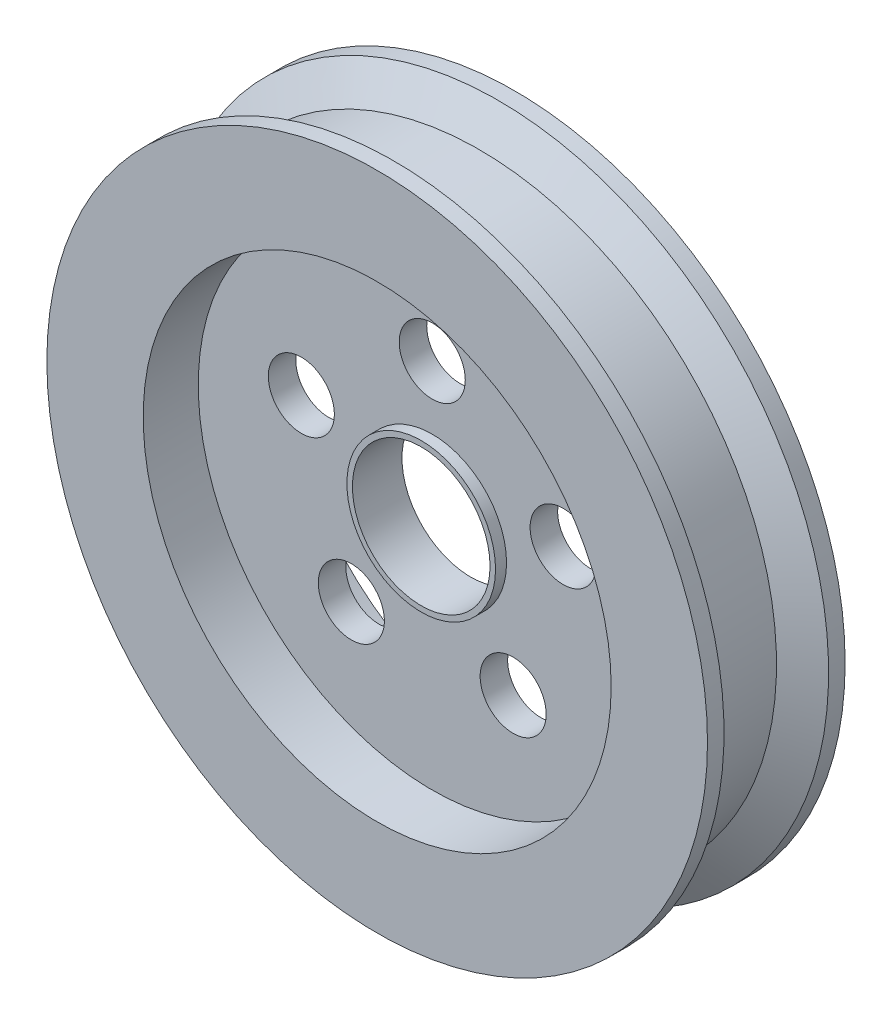
ISO-10303-21;
HEADER;
FILE_DESCRIPTION(('STEP AP214'),'2;1');
FILE_NAME('part.step','',(''),(''),'','','');
FILE_SCHEMA(('AUTOMOTIVE_DESIGN { 1 0 10303 214 1 1 1 1 }'));
ENDSEC;
DATA;
#1=APPLICATION_CONTEXT('core data for automotive mechanical design processes');
#2=APPLICATION_PROTOCOL_DEFINITION('international standard','automotive_design',2000,#1);
#3=PRODUCT_CONTEXT('',#1,'mechanical');
#4=PRODUCT('Part','Part','',(#3));
#5=PRODUCT_RELATED_PRODUCT_CATEGORY('part','',(#4));
#6=PRODUCT_DEFINITION_FORMATION('','',#4);
#7=PRODUCT_DEFINITION_CONTEXT('part definition',#1,'design');
#8=PRODUCT_DEFINITION('design','',#6,#7);
#9=PRODUCT_DEFINITION_SHAPE('','',#8);
#10=(LENGTH_UNIT() NAMED_UNIT(*) SI_UNIT(.MILLI.,.METRE.));
#11=(NAMED_UNIT(*) PLANE_ANGLE_UNIT() SI_UNIT($,.RADIAN.));
#12=(NAMED_UNIT(*) SI_UNIT($,.STERADIAN.) SOLID_ANGLE_UNIT());
#13=UNCERTAINTY_MEASURE_WITH_UNIT(LENGTH_MEASURE(1.E-05),#10,'distance_accuracy_value','');
#14=(GEOMETRIC_REPRESENTATION_CONTEXT(3) GLOBAL_UNCERTAINTY_ASSIGNED_CONTEXT((#13)) GLOBAL_UNIT_ASSIGNED_CONTEXT((#10,
#11,#12)) REPRESENTATION_CONTEXT('',''));
#15=CARTESIAN_POINT('',(0.,0.,0.));
#16=DIRECTION('',(0.,0.,1.));
#17=DIRECTION('',(1.,0.,0.));
#18=AXIS2_PLACEMENT_3D('',#15,#16,#17);
#19=CARTESIAN_POINT('',(0.,0.,12.5));
#20=DIRECTION('',(0.,0.,-1.));
#21=DIRECTION('',(-1.,0.,0.));
#22=AXIS2_PLACEMENT_3D('',#19,#20,#21);
#23=CYLINDRICAL_SURFACE('',#22,60.);
#24=CARTESIAN_POINT('',(0.,0.,-12.5));
#25=DIRECTION('',(0.,0.,1.));
#26=DIRECTION('',(1.,0.,0.));
#27=AXIS2_PLACEMENT_3D('',#24,#25,#26);
#28=CIRCLE('',#27,60.);
#29=CARTESIAN_POINT('',(60.,0.,-12.5));
#30=VERTEX_POINT('',#29);
#31=EDGE_CURVE('E89',#30,#30,#28,.T.);
#32=ORIENTED_EDGE('',*,*,#31,.T.);
#33=EDGE_LOOP('',(#32));
#34=FACE_BOUND('',#33,.T.);
#35=CARTESIAN_POINT('',(0.,0.,-9.5));
#36=DIRECTION('',(0.,0.,-1.));
#37=DIRECTION('',(-1.,0.,0.));
#38=AXIS2_PLACEMENT_3D('',#35,#36,#37);
#39=CIRCLE('',#38,60.);
#40=CARTESIAN_POINT('',(-60.,0.,-9.5));
#41=VERTEX_POINT('',#40);
#42=EDGE_CURVE('E56',#41,#41,#39,.T.);
#43=ORIENTED_EDGE('',*,*,#42,.T.);
#44=EDGE_LOOP('',(#43));
#45=FACE_BOUND('',#44,.T.);
#46=ADVANCED_FACE('F31',(#34,#45),#23,.T.);
#47=CARTESIAN_POINT('',(0.,0.,12.5));
#48=DIRECTION('',(0.,0.,1.));
#49=DIRECTION('',(1.,0.,0.));
#50=AXIS2_PLACEMENT_3D('',#47,#48,#49);
#51=CIRCLE('',#50,60.);
#52=CARTESIAN_POINT('',(60.,0.,12.5));
#53=VERTEX_POINT('',#52);
#54=EDGE_CURVE('E42',#53,#53,#51,.T.);
#55=ORIENTED_EDGE('',*,*,#54,.F.);
#56=EDGE_LOOP('',(#55));
#57=FACE_BOUND('',#56,.T.);
#58=CARTESIAN_POINT('',(0.,0.,9.5));
#59=DIRECTION('',(0.,0.,-1.));
#60=DIRECTION('',(-1.,0.,0.));
#61=AXIS2_PLACEMENT_3D('',#58,#59,#60);
#62=CIRCLE('',#61,60.);
#63=CARTESIAN_POINT('',(-60.,0.,9.5));
#64=VERTEX_POINT('',#63);
#65=EDGE_CURVE('E47',#64,#64,#62,.T.);
#66=ORIENTED_EDGE('',*,*,#65,.F.);
#67=EDGE_LOOP('',(#66));
#68=FACE_BOUND('',#67,.T.);
#69=ADVANCED_FACE('F135',(#57,#68),#23,.T.);
#70=CARTESIAN_POINT('',(0.,0.,-12.5));
#71=DIRECTION('',(0.,0.,1.));
#72=DIRECTION('',(1.,0.,0.));
#73=AXIS2_PLACEMENT_3D('',#70,#71,#72);
#74=PLANE('',#73);
#75=ORIENTED_EDGE('',*,*,#31,.F.);
#76=EDGE_LOOP('',(#75));
#77=FACE_BOUND('',#76,.T.);
#78=CARTESIAN_POINT('',(0.,0.,-12.5));
#79=DIRECTION('',(0.,0.,1.));
#80=DIRECTION('',(1.,0.,0.));
#81=AXIS2_PLACEMENT_3D('',#78,#79,#80);
#82=CIRCLE('',#81,42.5);
#83=CARTESIAN_POINT('',(42.5,0.,-12.5));
#84=VERTEX_POINT('',#83);
#85=EDGE_CURVE('E83',#84,#84,#82,.T.);
#86=ORIENTED_EDGE('',*,*,#85,.T.);
#87=EDGE_LOOP('',(#86));
#88=FACE_BOUND('',#87,.T.);
#89=ADVANCED_FACE('F132',(#77,#88),#74,.F.);
#90=CARTESIAN_POINT('',(0.,0.,12.5));
#91=DIRECTION('',(0.,0.,1.));
#92=DIRECTION('',(1.,0.,0.));
#93=AXIS2_PLACEMENT_3D('',#90,#91,#92);
#94=PLANE('',#93);
#95=CARTESIAN_POINT('',(0.,0.,12.5));
#96=DIRECTION('',(0.,0.,1.));
#97=DIRECTION('',(1.,0.,0.));
#98=AXIS2_PLACEMENT_3D('',#95,#96,#97);
#99=CIRCLE('',#98,42.5);
#100=CARTESIAN_POINT('',(42.5,0.,12.5));
#101=VERTEX_POINT('',#100);
#102=EDGE_CURVE('E82',#101,#101,#99,.T.);
#103=ORIENTED_EDGE('',*,*,#102,.F.);
#104=EDGE_LOOP('',(#103));
#105=FACE_BOUND('',#104,.T.);
#106=ORIENTED_EDGE('',*,*,#54,.T.);
#107=EDGE_LOOP('',(#106));
#108=FACE_BOUND('',#107,.T.);
#109=ADVANCED_FACE('F134',(#105,#108),#94,.T.);
#110=CARTESIAN_POINT('',(0.,0.,2.5));
#111=DIRECTION('',(0.,0.,1.));
#112=DIRECTION('',(1.,0.,0.));
#113=AXIS2_PLACEMENT_3D('',#110,#111,#112);
#114=CYLINDRICAL_SURFACE('',#113,42.5);
#115=CARTESIAN_POINT('',(0.,0.,2.5));
#116=DIRECTION('',(0.,0.,1.));
#117=DIRECTION('',(1.,0.,0.));
#118=AXIS2_PLACEMENT_3D('',#115,#116,#117);
#119=CIRCLE('',#118,42.5);
#120=CARTESIAN_POINT('',(42.5,0.,2.5));
#121=VERTEX_POINT('',#120);
#122=EDGE_CURVE('E86',#121,#121,#119,.T.);
#123=ORIENTED_EDGE('',*,*,#122,.F.);
#124=EDGE_LOOP('',(#123));
#125=FACE_BOUND('',#124,.T.);
#126=ORIENTED_EDGE('',*,*,#102,.T.);
#127=EDGE_LOOP('',(#126));
#128=FACE_BOUND('',#127,.T.);
#129=ADVANCED_FACE('F141',(#125,#128),#114,.F.);
#130=CARTESIAN_POINT('',(0.,0.,2.5));
#131=DIRECTION('',(0.,0.,1.));
#132=DIRECTION('',(1.,0.,0.));
#133=AXIS2_PLACEMENT_3D('',#130,#131,#132);
#134=PLANE('',#133);
#135=CARTESIAN_POINT('',(0.,0.,2.5));
#136=DIRECTION('',(0.,0.,1.));
#137=DIRECTION('',(1.,0.,0.));
#138=AXIS2_PLACEMENT_3D('',#135,#136,#137);
#139=CIRCLE('',#138,13.5);
#140=CARTESIAN_POINT('',(13.5,0.,2.5));
#141=VERTEX_POINT('',#140);
#142=EDGE_CURVE('E10',#141,#141,#139,.T.);
#143=ORIENTED_EDGE('',*,*,#142,.F.);
#144=EDGE_LOOP('',(#143));
#145=FACE_BOUND('',#144,.T.);
#146=CARTESIAN_POINT('',(-23.7764129073788,7.72542485937396,2.5));
#147=DIRECTION('',(0.,0.,1.));
#148=DIRECTION('',(0.309016994374958,0.95105651629515,0.));
#149=AXIS2_PLACEMENT_3D('',#146,#147,#148);
#150=CIRCLE('',#149,6.);
#151=CARTESIAN_POINT('',(-21.922310941129,13.4317639571449,2.5));
#152=VERTEX_POINT('',#151);
#153=EDGE_CURVE('E59',#152,#152,#150,.T.);
#154=ORIENTED_EDGE('',*,*,#153,.F.);
#155=EDGE_LOOP('',(#154));
#156=FACE_BOUND('',#155,.T.);
#157=CARTESIAN_POINT('',(-14.694631307312,-20.2254248593736,2.5));
#158=DIRECTION('',(0.,0.,1.));
#159=DIRECTION('',(-0.809016994374942,0.58778525229248,0.));
#160=AXIS2_PLACEMENT_3D('',#157,#158,#159);
#161=CIRCLE('',#160,6.);
#162=CARTESIAN_POINT('',(-19.5487332735617,-16.6987133456187,2.5));
#163=VERTEX_POINT('',#162);
#164=EDGE_CURVE('E63',#163,#163,#161,.T.);
#165=ORIENTED_EDGE('',*,*,#164,.F.);
#166=EDGE_LOOP('',(#165));
#167=FACE_BOUND('',#166,.T.);
#168=CARTESIAN_POINT('',(14.6946313073117,-20.2254248593738,2.5));
#169=DIRECTION('',(0.,0.,1.));
#170=DIRECTION('',(-0.809016994374951,-0.587785252292469,0.));
#171=AXIS2_PLACEMENT_3D('',#168,#169,#170);
#172=CIRCLE('',#171,6.);
#173=CARTESIAN_POINT('',(9.84052934106201,-23.7521363731286,2.5));
#174=VERTEX_POINT('',#173);
#175=EDGE_CURVE('E67',#174,#174,#172,.T.);
#176=ORIENTED_EDGE('',*,*,#175,.F.);
#177=EDGE_LOOP('',(#176));
#178=FACE_BOUND('',#177,.T.);
#179=CARTESIAN_POINT('',(23.7764129073789,7.72542485937362,2.5));
#180=DIRECTION('',(0.,0.,1.));
#181=DIRECTION('',(0.309016994374945,-0.951056516295155,0.));
#182=AXIS2_PLACEMENT_3D('',#179,#180,#181);
#183=CIRCLE('',#182,6.);
#184=CARTESIAN_POINT('',(25.6305148736285,2.01908576160269,2.5));
#185=VERTEX_POINT('',#184);
#186=EDGE_CURVE('E71',#185,#185,#183,.T.);
#187=ORIENTED_EDGE('',*,*,#186,.F.);
#188=EDGE_LOOP('',(#187));
#189=FACE_BOUND('',#188,.T.);
#190=CARTESIAN_POINT('',(0.,25.,2.5));
#191=DIRECTION('',(0.,0.,1.));
#192=DIRECTION('',(1.,0.,0.));
#193=AXIS2_PLACEMENT_3D('',#190,#191,#192);
#194=CIRCLE('',#193,6.);
#195=CARTESIAN_POINT('',(6.,25.,2.5));
#196=VERTEX_POINT('',#195);
#197=EDGE_CURVE('E75',#196,#196,#194,.T.);
#198=ORIENTED_EDGE('',*,*,#197,.F.);
#199=EDGE_LOOP('',(#198));
#200=FACE_BOUND('',#199,.T.);
#201=ORIENTED_EDGE('',*,*,#122,.T.);
#202=EDGE_LOOP('',(#201));
#203=FACE_BOUND('',#202,.T.);
#204=ADVANCED_FACE('F128',(#145,#156,#167,#178,#189,#200,#203),#134,.T.);
#205=CARTESIAN_POINT('',(0.,0.,-2.5));
#206=DIRECTION('',(0.,0.,-1.));
#207=DIRECTION('',(-1.,0.,0.));
#208=AXIS2_PLACEMENT_3D('',#205,#206,#207);
#209=CYLINDRICAL_SURFACE('',#208,42.5);
#210=CARTESIAN_POINT('',(0.,0.,-2.5));
#211=DIRECTION('',(0.,0.,1.));
#212=DIRECTION('',(1.,0.,0.));
#213=AXIS2_PLACEMENT_3D('',#210,#211,#212);
#214=CIRCLE('',#213,42.5);
#215=CARTESIAN_POINT('',(42.5,0.,-2.5));
#216=VERTEX_POINT('',#215);
#217=EDGE_CURVE('E79',#216,#216,#214,.T.);
#218=ORIENTED_EDGE('',*,*,#217,.T.);
#219=EDGE_LOOP('',(#218));
#220=FACE_BOUND('',#219,.T.);
#221=ORIENTED_EDGE('',*,*,#85,.F.);
#222=EDGE_LOOP('',(#221));
#223=FACE_BOUND('',#222,.T.);
#224=ADVANCED_FACE('F113',(#220,#223),#209,.F.);
#225=CARTESIAN_POINT('',(0.,0.,-2.5));
#226=DIRECTION('',(0.,0.,-1.));
#227=DIRECTION('',(1.,0.,0.));
#228=AXIS2_PLACEMENT_3D('',#225,#226,#227);
#229=PLANE('',#228);
#230=CARTESIAN_POINT('',(0.,0.,-2.5));
#231=DIRECTION('',(0.,0.,-1.));
#232=DIRECTION('',(-1.,0.,0.));
#233=AXIS2_PLACEMENT_3D('',#230,#231,#232);
#234=CIRCLE('',#233,13.5);
#235=CARTESIAN_POINT('',(-13.5,0.,-2.5));
#236=VERTEX_POINT('',#235);
#237=EDGE_CURVE('E34',#236,#236,#234,.T.);
#238=ORIENTED_EDGE('',*,*,#237,.F.);
#239=EDGE_LOOP('',(#238));
#240=FACE_BOUND('',#239,.T.);
#241=CARTESIAN_POINT('',(-23.7764129073788,7.72542485937396,-2.5));
#242=DIRECTION('',(0.,0.,-1.));
#243=DIRECTION('',(-1.,0.,0.));
#244=AXIS2_PLACEMENT_3D('',#241,#242,#243);
#245=CIRCLE('',#244,6.);
#246=CARTESIAN_POINT('',(-29.7764129073788,7.72542485937396,-2.5));
#247=VERTEX_POINT('',#246);
#248=EDGE_CURVE('E62',#247,#247,#245,.T.);
#249=ORIENTED_EDGE('',*,*,#248,.F.);
#250=EDGE_LOOP('',(#249));
#251=FACE_BOUND('',#250,.T.);
#252=CARTESIAN_POINT('',(-14.694631307312,-20.2254248593736,-2.5));
#253=DIRECTION('',(0.,0.,-1.));
#254=DIRECTION('',(-1.,0.,0.));
#255=AXIS2_PLACEMENT_3D('',#252,#253,#254);
#256=CIRCLE('',#255,6.);
#257=CARTESIAN_POINT('',(-20.694631307312,-20.2254248593736,-2.5));
#258=VERTEX_POINT('',#257);
#259=EDGE_CURVE('E66',#258,#258,#256,.T.);
#260=ORIENTED_EDGE('',*,*,#259,.F.);
#261=EDGE_LOOP('',(#260));
#262=FACE_BOUND('',#261,.T.);
#263=CARTESIAN_POINT('',(14.6946313073117,-20.2254248593738,-2.5));
#264=DIRECTION('',(0.,0.,-1.));
#265=DIRECTION('',(-1.,0.,0.));
#266=AXIS2_PLACEMENT_3D('',#263,#264,#265);
#267=CIRCLE('',#266,6.);
#268=CARTESIAN_POINT('',(8.69463130731171,-20.2254248593738,-2.5));
#269=VERTEX_POINT('',#268);
#270=EDGE_CURVE('E70',#269,#269,#267,.T.);
#271=ORIENTED_EDGE('',*,*,#270,.F.);
#272=EDGE_LOOP('',(#271));
#273=FACE_BOUND('',#272,.T.);
#274=CARTESIAN_POINT('',(23.7764129073789,7.72542485937362,-2.5));
#275=DIRECTION('',(0.,0.,-1.));
#276=DIRECTION('',(-1.,0.,0.));
#277=AXIS2_PLACEMENT_3D('',#274,#275,#276);
#278=CIRCLE('',#277,6.);
#279=CARTESIAN_POINT('',(17.7764129073789,7.72542485937362,-2.5));
#280=VERTEX_POINT('',#279);
#281=EDGE_CURVE('E74',#280,#280,#278,.T.);
#282=ORIENTED_EDGE('',*,*,#281,.F.);
#283=EDGE_LOOP('',(#282));
#284=FACE_BOUND('',#283,.T.);
#285=CARTESIAN_POINT('',(0.,25.,-2.5));
#286=DIRECTION('',(0.,0.,-1.));
#287=DIRECTION('',(-1.,0.,0.));
#288=AXIS2_PLACEMENT_3D('',#285,#286,#287);
#289=CIRCLE('',#288,6.);
#290=CARTESIAN_POINT('',(-6.,25.,-2.5));
#291=VERTEX_POINT('',#290);
#292=EDGE_CURVE('E78',#291,#291,#289,.T.);
#293=ORIENTED_EDGE('',*,*,#292,.F.);
#294=EDGE_LOOP('',(#293));
#295=FACE_BOUND('',#294,.T.);
#296=ORIENTED_EDGE('',*,*,#217,.F.);
#297=EDGE_LOOP('',(#296));
#298=FACE_BOUND('',#297,.T.);
#299=ADVANCED_FACE('F109',(#240,#251,#262,#273,#284,#295,#298),#229,.T.);
#300=CARTESIAN_POINT('',(0.,25.,-12.5));
#301=DIRECTION('',(0.,0.,1.));
#302=DIRECTION('',(1.,0.,0.));
#303=AXIS2_PLACEMENT_3D('',#300,#301,#302);
#304=CYLINDRICAL_SURFACE('',#303,6.);
#305=ORIENTED_EDGE('',*,*,#292,.T.);
#306=EDGE_LOOP('',(#305));
#307=FACE_BOUND('',#306,.T.);
#308=ORIENTED_EDGE('',*,*,#197,.T.);
#309=EDGE_LOOP('',(#308));
#310=FACE_BOUND('',#309,.T.);
#311=ADVANCED_FACE('F112',(#307,#310),#304,.F.);
#312=CARTESIAN_POINT('',(23.7764129073789,7.72542485937362,-12.5));
#313=DIRECTION('',(0.,0.,1.));
#314=DIRECTION('',(1.,0.,0.));
#315=AXIS2_PLACEMENT_3D('',#312,#313,#314);
#316=CYLINDRICAL_SURFACE('',#315,6.);
#317=ORIENTED_EDGE('',*,*,#281,.T.);
#318=EDGE_LOOP('',(#317));
#319=FACE_BOUND('',#318,.T.);
#320=ORIENTED_EDGE('',*,*,#186,.T.);
#321=EDGE_LOOP('',(#320));
#322=FACE_BOUND('',#321,.T.);
#323=ADVANCED_FACE('F175',(#319,#322),#316,.F.);
#324=CARTESIAN_POINT('',(14.6946313073117,-20.2254248593738,-12.5));
#325=DIRECTION('',(0.,0.,1.));
#326=DIRECTION('',(1.,0.,0.));
#327=AXIS2_PLACEMENT_3D('',#324,#325,#326);
#328=CYLINDRICAL_SURFACE('',#327,6.);
#329=ORIENTED_EDGE('',*,*,#270,.T.);
#330=EDGE_LOOP('',(#329));
#331=FACE_BOUND('',#330,.T.);
#332=ORIENTED_EDGE('',*,*,#175,.T.);
#333=EDGE_LOOP('',(#332));
#334=FACE_BOUND('',#333,.T.);
#335=ADVANCED_FACE('F171',(#331,#334),#328,.F.);
#336=CARTESIAN_POINT('',(-14.694631307312,-20.2254248593736,-12.5));
#337=DIRECTION('',(0.,0.,1.));
#338=DIRECTION('',(1.,0.,0.));
#339=AXIS2_PLACEMENT_3D('',#336,#337,#338);
#340=CYLINDRICAL_SURFACE('',#339,6.);
#341=ORIENTED_EDGE('',*,*,#259,.T.);
#342=EDGE_LOOP('',(#341));
#343=FACE_BOUND('',#342,.T.);
#344=ORIENTED_EDGE('',*,*,#164,.T.);
#345=EDGE_LOOP('',(#344));
#346=FACE_BOUND('',#345,.T.);
#347=ADVANCED_FACE('F165',(#343,#346),#340,.F.);
#348=CARTESIAN_POINT('',(-23.7764129073788,7.72542485937396,-12.5));
#349=DIRECTION('',(0.,0.,1.));
#350=DIRECTION('',(1.,0.,0.));
#351=AXIS2_PLACEMENT_3D('',#348,#349,#350);
#352=CYLINDRICAL_SURFACE('',#351,6.);
#353=ORIENTED_EDGE('',*,*,#248,.T.);
#354=EDGE_LOOP('',(#353));
#355=FACE_BOUND('',#354,.T.);
#356=ORIENTED_EDGE('',*,*,#153,.T.);
#357=EDGE_LOOP('',(#356));
#358=FACE_BOUND('',#357,.T.);
#359=ADVANCED_FACE('F106',(#355,#358),#352,.F.);
#360=CARTESIAN_POINT('',(0.,0.,-9.5));
#361=DIRECTION('',(0.,0.,-1.));
#362=DIRECTION('',(-1.,0.,0.));
#363=AXIS2_PLACEMENT_3D('',#360,#361,#362);
#364=CONICAL_SURFACE('',#363,60.,1.04719755119659);
#365=CARTESIAN_POINT('',(0.,0.,-6.03589838486221));
#366=DIRECTION('',(0.,0.,-1.));
#367=DIRECTION('',(-1.,0.,0.));
#368=AXIS2_PLACEMENT_3D('',#365,#366,#367);
#369=CIRCLE('',#368,54.);
#370=CARTESIAN_POINT('',(-54.,0.,-6.03589838486221));
#371=VERTEX_POINT('',#370);
#372=EDGE_CURVE('E53',#371,#371,#369,.T.);
#373=ORIENTED_EDGE('',*,*,#372,.T.);
#374=EDGE_LOOP('',(#373));
#375=FACE_BOUND('',#374,.T.);
#376=ORIENTED_EDGE('',*,*,#42,.F.);
#377=EDGE_LOOP('',(#376));
#378=FACE_BOUND('',#377,.T.);
#379=ADVANCED_FACE('F153',(#375,#378),#364,.T.);
#380=CARTESIAN_POINT('',(0.,0.,-27.8149395659714));
#381=DIRECTION('',(0.,0.,-1.));
#382=DIRECTION('',(-1.,0.,0.));
#383=AXIS2_PLACEMENT_3D('',#380,#381,#382);
#384=CYLINDRICAL_SURFACE('',#383,54.);
#385=CARTESIAN_POINT('',(0.,0.,6.03589838486221));
#386=DIRECTION('',(0.,0.,-1.));
#387=DIRECTION('',(-1.,0.,0.));
#388=AXIS2_PLACEMENT_3D('',#385,#386,#387);
#389=CIRCLE('',#388,54.);
#390=CARTESIAN_POINT('',(-54.,0.,6.03589838486221));
#391=VERTEX_POINT('',#390);
#392=EDGE_CURVE('E50',#391,#391,#389,.T.);
#393=ORIENTED_EDGE('',*,*,#392,.T.);
#394=EDGE_LOOP('',(#393));
#395=FACE_BOUND('',#394,.T.);
#396=ORIENTED_EDGE('',*,*,#372,.F.);
#397=EDGE_LOOP('',(#396));
#398=FACE_BOUND('',#397,.T.);
#399=ADVANCED_FACE('F155',(#395,#398),#384,.T.);
#400=CARTESIAN_POINT('',(0.,0.,6.03589838486221));
#401=DIRECTION('',(0.,0.,1.));
#402=DIRECTION('',(1.,0.,0.));
#403=AXIS2_PLACEMENT_3D('',#400,#401,#402);
#404=CONICAL_SURFACE('',#403,54.,1.04719755119659);
#405=ORIENTED_EDGE('',*,*,#65,.T.);
#406=EDGE_LOOP('',(#405));
#407=FACE_BOUND('',#406,.T.);
#408=ORIENTED_EDGE('',*,*,#392,.F.);
#409=EDGE_LOOP('',(#408));
#410=FACE_BOUND('',#409,.T.);
#411=ADVANCED_FACE('F162',(#407,#410),#404,.T.);
#412=CARTESIAN_POINT('',(0.,0.,-4.5));
#413=DIRECTION('',(0.,0.,1.));
#414=DIRECTION('',(1.,0.,0.));
#415=AXIS2_PLACEMENT_3D('',#412,#413,#414);
#416=CYLINDRICAL_SURFACE('',#415,13.5);
#417=ORIENTED_EDGE('',*,*,#237,.T.);
#418=EDGE_LOOP('',(#417));
#419=FACE_BOUND('',#418,.T.);
#420=CARTESIAN_POINT('',(0.,0.,-4.5));
#421=DIRECTION('',(0.,0.,1.));
#422=DIRECTION('',(1.,0.,0.));
#423=AXIS2_PLACEMENT_3D('',#420,#421,#422);
#424=CIRCLE('',#423,13.5);
#425=CARTESIAN_POINT('',(13.5,0.,-4.5));
#426=VERTEX_POINT('',#425);
#427=EDGE_CURVE('E45',#426,#426,#424,.T.);
#428=ORIENTED_EDGE('',*,*,#427,.T.);
#429=EDGE_LOOP('',(#428));
#430=FACE_BOUND('',#429,.T.);
#431=ADVANCED_FACE('F215',(#419,#430),#416,.T.);
#432=CARTESIAN_POINT('',(0.,0.,-4.5));
#433=DIRECTION('',(0.,0.,1.));
#434=DIRECTION('',(1.,0.,0.));
#435=AXIS2_PLACEMENT_3D('',#432,#433,#434);
#436=PLANE('',#435);
#437=CARTESIAN_POINT('',(0.,0.,-4.5));
#438=DIRECTION('',(0.,0.,1.));
#439=DIRECTION('',(1.,0.,0.));
#440=AXIS2_PLACEMENT_3D('',#437,#438,#439);
#441=CIRCLE('',#440,12.5);
#442=CARTESIAN_POINT('',(12.5,0.,-4.5));
#443=VERTEX_POINT('',#442);
#444=EDGE_CURVE('E202',#443,#443,#441,.T.);
#445=ORIENTED_EDGE('',*,*,#444,.T.);
#446=EDGE_LOOP('',(#445));
#447=FACE_BOUND('',#446,.T.);
#448=ORIENTED_EDGE('',*,*,#427,.F.);
#449=EDGE_LOOP('',(#448));
#450=FACE_BOUND('',#449,.T.);
#451=ADVANCED_FACE('F217',(#447,#450),#436,.F.);
#452=ORIENTED_EDGE('',*,*,#142,.T.);
#453=EDGE_LOOP('',(#452));
#454=FACE_BOUND('',#453,.T.);
#455=CARTESIAN_POINT('',(0.,0.,4.5));
#456=DIRECTION('',(0.,0.,1.));
#457=DIRECTION('',(1.,0.,0.));
#458=AXIS2_PLACEMENT_3D('',#455,#456,#457);
#459=CIRCLE('',#458,13.5);
#460=CARTESIAN_POINT('',(13.5,0.,4.5));
#461=VERTEX_POINT('',#460);
#462=EDGE_CURVE('E207',#461,#461,#459,.T.);
#463=ORIENTED_EDGE('',*,*,#462,.F.);
#464=EDGE_LOOP('',(#463));
#465=FACE_BOUND('',#464,.T.);
#466=ADVANCED_FACE('F196',(#454,#465),#416,.T.);
#467=CARTESIAN_POINT('',(0.,0.,4.5));
#468=DIRECTION('',(0.,0.,1.));
#469=DIRECTION('',(1.,0.,0.));
#470=AXIS2_PLACEMENT_3D('',#467,#468,#469);
#471=PLANE('',#470);
#472=ORIENTED_EDGE('',*,*,#462,.T.);
#473=EDGE_LOOP('',(#472));
#474=FACE_BOUND('',#473,.T.);
#475=CARTESIAN_POINT('',(0.,0.,4.5));
#476=DIRECTION('',(0.,0.,1.));
#477=DIRECTION('',(1.,0.,0.));
#478=AXIS2_PLACEMENT_3D('',#475,#476,#477);
#479=CIRCLE('',#478,12.5);
#480=CARTESIAN_POINT('',(12.5,0.,4.5));
#481=VERTEX_POINT('',#480);
#482=EDGE_CURVE('E205',#481,#481,#479,.T.);
#483=ORIENTED_EDGE('',*,*,#482,.F.);
#484=EDGE_LOOP('',(#483));
#485=FACE_BOUND('',#484,.T.);
#486=ADVANCED_FACE('F191',(#474,#485),#471,.T.);
#487=CARTESIAN_POINT('',(0.,0.,12.5));
#488=DIRECTION('',(0.,0.,-1.));
#489=DIRECTION('',(-1.,0.,0.));
#490=AXIS2_PLACEMENT_3D('',#487,#488,#489);
#491=CYLINDRICAL_SURFACE('',#490,12.5);
#492=ORIENTED_EDGE('',*,*,#444,.F.);
#493=EDGE_LOOP('',(#492));
#494=FACE_BOUND('',#493,.T.);
#495=ORIENTED_EDGE('',*,*,#482,.T.);
#496=EDGE_LOOP('',(#495));
#497=FACE_BOUND('',#496,.T.);
#498=ADVANCED_FACE('F189',(#494,#497),#491,.F.);
#499=CLOSED_SHELL('',(#46,#69,#89,#109,#129,#204,#224,#299,#311,#323,#335,#347,#359,#379,#399,
#411,#431,#451,#466,#486,#498));
#500=MANIFOLD_SOLID_BREP('B2',#499);
#501=ADVANCED_BREP_SHAPE_REPRESENTATION('',(#18,#500),#14);
#502=SHAPE_DEFINITION_REPRESENTATION(#9,#501);
ENDSEC;
END-ISO-10303-21;
